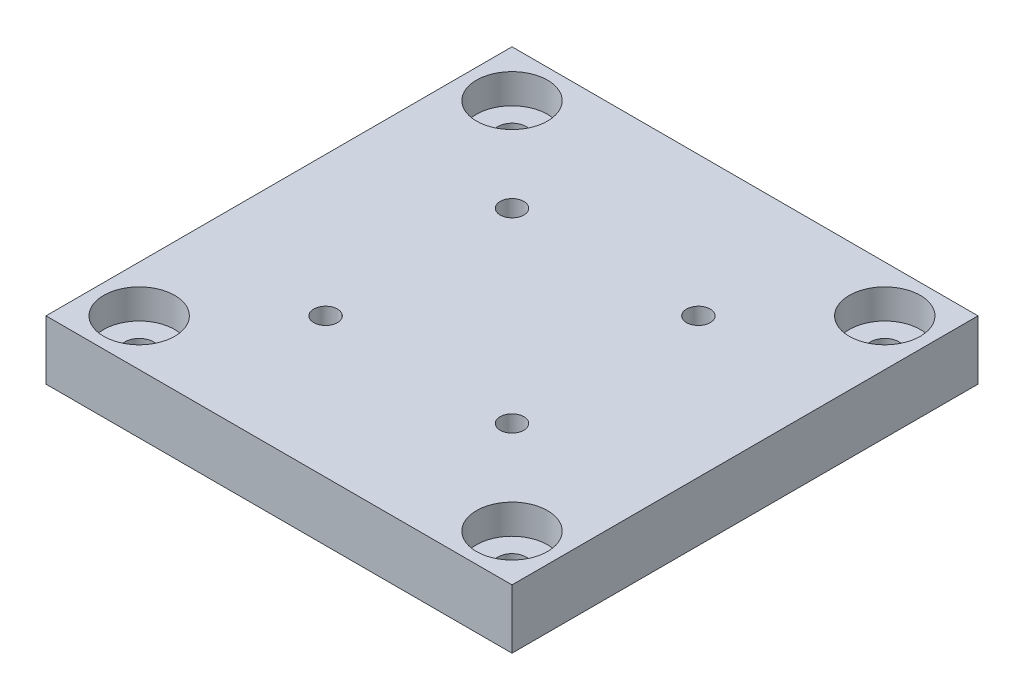
ISO-10303-21;
HEADER;
FILE_DESCRIPTION(('STEP AP214'),'2;1');
FILE_NAME('part.step','',(''),(''),'','','');
FILE_SCHEMA(('AUTOMOTIVE_DESIGN { 1 0 10303 214 1 1 1 1 }'));
ENDSEC;
DATA;
#1=APPLICATION_CONTEXT('core data for automotive mechanical design processes');
#2=APPLICATION_PROTOCOL_DEFINITION('international standard','automotive_design',2000,#1);
#3=PRODUCT_CONTEXT('',#1,'mechanical');
#4=PRODUCT('Part','Part','',(#3));
#5=PRODUCT_RELATED_PRODUCT_CATEGORY('part','',(#4));
#6=PRODUCT_DEFINITION_FORMATION('','',#4);
#7=PRODUCT_DEFINITION_CONTEXT('part definition',#1,'design');
#8=PRODUCT_DEFINITION('design','',#6,#7);
#9=PRODUCT_DEFINITION_SHAPE('','',#8);
#10=(LENGTH_UNIT() NAMED_UNIT(*) SI_UNIT(.MILLI.,.METRE.));
#11=(NAMED_UNIT(*) PLANE_ANGLE_UNIT() SI_UNIT($,.RADIAN.));
#12=(NAMED_UNIT(*) SI_UNIT($,.STERADIAN.) SOLID_ANGLE_UNIT());
#13=UNCERTAINTY_MEASURE_WITH_UNIT(LENGTH_MEASURE(1.E-05),#10,'distance_accuracy_value','');
#14=(GEOMETRIC_REPRESENTATION_CONTEXT(3) GLOBAL_UNCERTAINTY_ASSIGNED_CONTEXT((#13)) GLOBAL_UNIT_ASSIGNED_CONTEXT((#10,
#11,#12)) REPRESENTATION_CONTEXT('',''));
#15=CARTESIAN_POINT('',(0.,0.,0.));
#16=DIRECTION('',(0.,0.,1.));
#17=DIRECTION('',(1.,0.,0.));
#18=AXIS2_PLACEMENT_3D('',#15,#16,#17);
#19=CARTESIAN_POINT('',(4.99993919999998,6.35,-44.9999608));
#20=DIRECTION('',(0.,-1.,0.));
#21=DIRECTION('',(0.,0.,-1.));
#22=AXIS2_PLACEMENT_3D('',#19,#20,#21);
#23=CYLINDRICAL_SURFACE('',#22,1.524);
#24=CARTESIAN_POINT('',(4.99993919999998,0.,-44.9999608));
#25=DIRECTION('',(0.,1.,0.));
#26=DIRECTION('',(0.,0.,1.));
#27=AXIS2_PLACEMENT_3D('',#24,#25,#26);
#28=CIRCLE('',#27,1.524);
#29=CARTESIAN_POINT('',(4.99993919999998,0.,-43.4759608));
#30=VERTEX_POINT('',#29);
#31=EDGE_CURVE('E116',#30,#30,#28,.T.);
#32=ORIENTED_EDGE('',*,*,#31,.F.);
#33=EDGE_LOOP('',(#32));
#34=FACE_BOUND('',#33,.T.);
#35=CARTESIAN_POINT('',(4.99993919999998,3.175,-44.9999608));
#36=DIRECTION('',(0.,1.,0.));
#37=DIRECTION('',(0.,0.,1.));
#38=AXIS2_PLACEMENT_3D('',#35,#36,#37);
#39=CIRCLE('',#38,1.524);
#40=CARTESIAN_POINT('',(4.99993919999998,3.175,-43.4759608));
#41=VERTEX_POINT('',#40);
#42=EDGE_CURVE('E43',#41,#41,#39,.T.);
#43=ORIENTED_EDGE('',*,*,#42,.T.);
#44=EDGE_LOOP('',(#43));
#45=FACE_BOUND('',#44,.T.);
#46=ADVANCED_FACE('F39',(#34,#45),#23,.F.);
#47=CARTESIAN_POINT('',(44.9999608,6.35,-44.9999608));
#48=DIRECTION('',(0.,-1.,0.));
#49=DIRECTION('',(0.,0.,-1.));
#50=AXIS2_PLACEMENT_3D('',#47,#48,#49);
#51=CYLINDRICAL_SURFACE('',#50,1.524);
#52=CARTESIAN_POINT('',(44.9999608,0.,-44.9999608));
#53=DIRECTION('',(0.,1.,0.));
#54=DIRECTION('',(0.,0.,1.));
#55=AXIS2_PLACEMENT_3D('',#52,#53,#54);
#56=CIRCLE('',#55,1.524);
#57=CARTESIAN_POINT('',(44.9999608,0.,-43.4759608));
#58=VERTEX_POINT('',#57);
#59=EDGE_CURVE('E188',#58,#58,#56,.T.);
#60=ORIENTED_EDGE('',*,*,#59,.F.);
#61=EDGE_LOOP('',(#60));
#62=FACE_BOUND('',#61,.T.);
#63=CARTESIAN_POINT('',(44.9999608,3.175,-44.9999608));
#64=DIRECTION('',(0.,1.,0.));
#65=DIRECTION('',(0.,0.,1.));
#66=AXIS2_PLACEMENT_3D('',#63,#64,#65);
#67=CIRCLE('',#66,1.524);
#68=CARTESIAN_POINT('',(44.9999608,3.175,-43.4759608));
#69=VERTEX_POINT('',#68);
#70=EDGE_CURVE('E135',#69,#69,#67,.T.);
#71=ORIENTED_EDGE('',*,*,#70,.T.);
#72=EDGE_LOOP('',(#71));
#73=FACE_BOUND('',#72,.T.);
#74=ADVANCED_FACE('F201',(#62,#73),#51,.F.);
#75=CARTESIAN_POINT('',(44.9999608,6.35,-4.9999392));
#76=DIRECTION('',(0.,-1.,0.));
#77=DIRECTION('',(0.,0.,-1.));
#78=AXIS2_PLACEMENT_3D('',#75,#76,#77);
#79=CYLINDRICAL_SURFACE('',#78,1.524);
#80=CARTESIAN_POINT('',(44.9999608,0.,-4.9999392));
#81=DIRECTION('',(0.,1.,0.));
#82=DIRECTION('',(0.,0.,1.));
#83=AXIS2_PLACEMENT_3D('',#80,#81,#82);
#84=CIRCLE('',#83,1.524);
#85=CARTESIAN_POINT('',(44.9999608,0.,-3.4759392));
#86=VERTEX_POINT('',#85);
#87=EDGE_CURVE('E184',#86,#86,#84,.T.);
#88=ORIENTED_EDGE('',*,*,#87,.F.);
#89=EDGE_LOOP('',(#88));
#90=FACE_BOUND('',#89,.T.);
#91=CARTESIAN_POINT('',(44.9999608,3.175,-4.9999392));
#92=DIRECTION('',(0.,1.,0.));
#93=DIRECTION('',(0.,0.,1.));
#94=AXIS2_PLACEMENT_3D('',#91,#92,#93);
#95=CIRCLE('',#94,1.524);
#96=CARTESIAN_POINT('',(44.9999608,3.175,-3.4759392));
#97=VERTEX_POINT('',#96);
#98=EDGE_CURVE('E131',#97,#97,#95,.T.);
#99=ORIENTED_EDGE('',*,*,#98,.T.);
#100=EDGE_LOOP('',(#99));
#101=FACE_BOUND('',#100,.T.);
#102=ADVANCED_FACE('F206',(#90,#101),#79,.F.);
#103=CARTESIAN_POINT('',(4.99993919999999,6.35,-4.99993919999999));
#104=DIRECTION('',(0.,-1.,0.));
#105=DIRECTION('',(0.,0.,-1.));
#106=AXIS2_PLACEMENT_3D('',#103,#104,#105);
#107=CYLINDRICAL_SURFACE('',#106,1.524);
#108=CARTESIAN_POINT('',(4.99993919999999,0.,-4.99993919999999));
#109=DIRECTION('',(0.,1.,0.));
#110=DIRECTION('',(0.,0.,1.));
#111=AXIS2_PLACEMENT_3D('',#108,#109,#110);
#112=CIRCLE('',#111,1.524);
#113=CARTESIAN_POINT('',(4.99993919999999,0.,-3.47593919999999));
#114=VERTEX_POINT('',#113);
#115=EDGE_CURVE('E177',#114,#114,#112,.T.);
#116=ORIENTED_EDGE('',*,*,#115,.F.);
#117=EDGE_LOOP('',(#116));
#118=FACE_BOUND('',#117,.T.);
#119=CARTESIAN_POINT('',(4.99993919999999,3.175,-4.99993919999999));
#120=DIRECTION('',(0.,1.,0.));
#121=DIRECTION('',(0.,0.,1.));
#122=AXIS2_PLACEMENT_3D('',#119,#120,#121);
#123=CIRCLE('',#122,1.524);
#124=CARTESIAN_POINT('',(4.99993919999999,3.175,-3.47593919999999));
#125=VERTEX_POINT('',#124);
#126=EDGE_CURVE('E127',#125,#125,#123,.T.);
#127=ORIENTED_EDGE('',*,*,#126,.T.);
#128=EDGE_LOOP('',(#127));
#129=FACE_BOUND('',#128,.T.);
#130=ADVANCED_FACE('F213',(#118,#129),#107,.F.);
#131=CARTESIAN_POINT('',(0.,6.35,0.));
#132=DIRECTION('',(0.,-1.,0.));
#133=DIRECTION('',(0.,0.,-1.));
#134=AXIS2_PLACEMENT_3D('',#131,#132,#133);
#135=PLANE('',#134);
#136=CARTESIAN_POINT('',(44.9999608,6.35,-44.9999608));
#137=DIRECTION('',(0.,1.,0.));
#138=DIRECTION('',(0.,0.,1.));
#139=AXIS2_PLACEMENT_3D('',#136,#137,#138);
#140=CIRCLE('',#139,3.81);
#141=CARTESIAN_POINT('',(44.9999608,6.35,-41.1899608));
#142=VERTEX_POINT('',#141);
#143=EDGE_CURVE('E291',#142,#142,#140,.T.);
#144=ORIENTED_EDGE('',*,*,#143,.F.);
#145=EDGE_LOOP('',(#144));
#146=FACE_BOUND('',#145,.T.);
#147=CARTESIAN_POINT('',(4.99993919999999,6.35,-4.99993919999999));
#148=DIRECTION('',(0.,1.,0.));
#149=DIRECTION('',(0.,0.,1.));
#150=AXIS2_PLACEMENT_3D('',#147,#148,#149);
#151=CIRCLE('',#150,3.81);
#152=CARTESIAN_POINT('',(4.99993919999999,6.35,-1.18993919999999));
#153=VERTEX_POINT('',#152);
#154=EDGE_CURVE('E275',#153,#153,#151,.T.);
#155=ORIENTED_EDGE('',*,*,#154,.F.);
#156=EDGE_LOOP('',(#155));
#157=FACE_BOUND('',#156,.T.);
#158=CARTESIAN_POINT('',(44.9999608,6.35,-4.9999392));
#159=DIRECTION('',(0.,1.,0.));
#160=DIRECTION('',(0.,0.,1.));
#161=AXIS2_PLACEMENT_3D('',#158,#159,#160);
#162=CIRCLE('',#161,3.81);
#163=CARTESIAN_POINT('',(44.9999608,6.35,-1.1899392));
#164=VERTEX_POINT('',#163);
#165=EDGE_CURVE('E276',#164,#164,#162,.T.);
#166=ORIENTED_EDGE('',*,*,#165,.F.);
#167=EDGE_LOOP('',(#166));
#168=FACE_BOUND('',#167,.T.);
#169=CARTESIAN_POINT('',(4.99993919999998,6.35,-44.9999608));
#170=DIRECTION('',(0.,1.,0.));
#171=DIRECTION('',(0.,0.,1.));
#172=AXIS2_PLACEMENT_3D('',#169,#170,#171);
#173=CIRCLE('',#172,3.81);
#174=CARTESIAN_POINT('',(4.99993919999998,6.35,-41.1899608));
#175=VERTEX_POINT('',#174);
#176=EDGE_CURVE('E290',#175,#175,#173,.T.);
#177=ORIENTED_EDGE('',*,*,#176,.F.);
#178=EDGE_LOOP('',(#177));
#179=FACE_BOUND('',#178,.T.);
#180=DIRECTION('',(1.,0.,0.));
#181=VECTOR('',#180,1.);
#182=CARTESIAN_POINT('',(49.9999,6.35,0.));
#183=LINE('',#182,#181);
#184=CARTESIAN_POINT('',(0.,6.35,0.));
#185=VERTEX_POINT('',#184);
#186=CARTESIAN_POINT('',(49.9999,6.35,0.));
#187=VERTEX_POINT('',#186);
#188=EDGE_CURVE('E95',#185,#187,#183,.T.);
#189=ORIENTED_EDGE('',*,*,#188,.T.);
#190=DIRECTION('',(0.,0.,-1.));
#191=VECTOR('',#190,1.);
#192=CARTESIAN_POINT('',(49.9999,6.35,-49.9999));
#193=LINE('',#192,#191);
#194=CARTESIAN_POINT('',(49.9999,6.35,-49.9999));
#195=VERTEX_POINT('',#194);
#196=EDGE_CURVE('E89',#187,#195,#193,.T.);
#197=ORIENTED_EDGE('',*,*,#196,.T.);
#198=DIRECTION('',(-1.,0.,0.));
#199=VECTOR('',#198,1.);
#200=CARTESIAN_POINT('',(0.,6.35,-49.9999));
#201=LINE('',#200,#199);
#202=CARTESIAN_POINT('',(0.,6.35,-49.9999));
#203=VERTEX_POINT('',#202);
#204=EDGE_CURVE('E93',#195,#203,#201,.T.);
#205=ORIENTED_EDGE('',*,*,#204,.T.);
#206=DIRECTION('',(0.,0.,1.));
#207=VECTOR('',#206,1.);
#208=CARTESIAN_POINT('',(0.,6.35,0.));
#209=LINE('',#208,#207);
#210=EDGE_CURVE('E59',#203,#185,#209,.T.);
#211=ORIENTED_EDGE('',*,*,#210,.T.);
#212=EDGE_LOOP('',(#189,#197,#205,#211));
#213=FACE_BOUND('',#212,.T.);
#214=CARTESIAN_POINT('',(14.9999446,6.35,-34.9999554));
#215=DIRECTION('',(0.,1.,0.));
#216=DIRECTION('',(0.,0.,1.));
#217=AXIS2_PLACEMENT_3D('',#214,#215,#216);
#218=CIRCLE('',#217,1.27000000000002);
#219=CARTESIAN_POINT('',(14.9999446,6.35,-33.7299554));
#220=VERTEX_POINT('',#219);
#221=EDGE_CURVE('E173',#220,#220,#218,.T.);
#222=ORIENTED_EDGE('',*,*,#221,.F.);
#223=EDGE_LOOP('',(#222));
#224=FACE_BOUND('',#223,.T.);
#225=CARTESIAN_POINT('',(34.9999554,6.35,-34.9999554));
#226=DIRECTION('',(0.,1.,0.));
#227=DIRECTION('',(0.,0.,1.));
#228=AXIS2_PLACEMENT_3D('',#225,#226,#227);
#229=CIRCLE('',#228,1.27);
#230=CARTESIAN_POINT('',(34.9999554,6.35,-33.7299554));
#231=VERTEX_POINT('',#230);
#232=EDGE_CURVE('E165',#231,#231,#229,.T.);
#233=ORIENTED_EDGE('',*,*,#232,.F.);
#234=EDGE_LOOP('',(#233));
#235=FACE_BOUND('',#234,.T.);
#236=CARTESIAN_POINT('',(34.9999554,6.35,-14.9999446));
#237=DIRECTION('',(0.,1.,0.));
#238=DIRECTION('',(0.,0.,1.));
#239=AXIS2_PLACEMENT_3D('',#236,#237,#238);
#240=CIRCLE('',#239,1.27);
#241=CARTESIAN_POINT('',(34.9999554,6.35,-13.7299446));
#242=VERTEX_POINT('',#241);
#243=EDGE_CURVE('E157',#242,#242,#240,.T.);
#244=ORIENTED_EDGE('',*,*,#243,.F.);
#245=EDGE_LOOP('',(#244));
#246=FACE_BOUND('',#245,.T.);
#247=CARTESIAN_POINT('',(14.9999446,6.35,-14.9999446));
#248=DIRECTION('',(0.,1.,0.));
#249=DIRECTION('',(0.,0.,1.));
#250=AXIS2_PLACEMENT_3D('',#247,#248,#249);
#251=CIRCLE('',#250,1.27);
#252=CARTESIAN_POINT('',(14.9999446,6.35,-13.7299446));
#253=VERTEX_POINT('',#252);
#254=EDGE_CURVE('E147',#253,#253,#251,.T.);
#255=ORIENTED_EDGE('',*,*,#254,.F.);
#256=EDGE_LOOP('',(#255));
#257=FACE_BOUND('',#256,.T.);
#258=ADVANCED_FACE('F90',(#146,#157,#168,#179,#213,#224,#235,#246,#257),#135,.F.);
#259=CARTESIAN_POINT('',(0.,0.,0.));
#260=DIRECTION('',(0.,-1.,0.));
#261=DIRECTION('',(0.,0.,-1.));
#262=AXIS2_PLACEMENT_3D('',#259,#260,#261);
#263=PLANE('',#262);
#264=CARTESIAN_POINT('',(34.9999554,0.,-14.9999446));
#265=DIRECTION('',(0.,1.,0.));
#266=DIRECTION('',(0.,0.,1.));
#267=AXIS2_PLACEMENT_3D('',#264,#265,#266);
#268=CIRCLE('',#267,1.27);
#269=CARTESIAN_POINT('',(34.9999554,0.,-13.7299446));
#270=VERTEX_POINT('',#269);
#271=EDGE_CURVE('E153',#270,#270,#268,.T.);
#272=ORIENTED_EDGE('',*,*,#271,.T.);
#273=EDGE_LOOP('',(#272));
#274=FACE_BOUND('',#273,.T.);
#275=CARTESIAN_POINT('',(14.9999446,0.,-34.9999554));
#276=DIRECTION('',(0.,1.,0.));
#277=DIRECTION('',(0.,0.,1.));
#278=AXIS2_PLACEMENT_3D('',#275,#276,#277);
#279=CIRCLE('',#278,1.27000000000002);
#280=CARTESIAN_POINT('',(14.9999446,0.,-33.7299554));
#281=VERTEX_POINT('',#280);
#282=EDGE_CURVE('E169',#281,#281,#279,.T.);
#283=ORIENTED_EDGE('',*,*,#282,.T.);
#284=EDGE_LOOP('',(#283));
#285=FACE_BOUND('',#284,.T.);
#286=ORIENTED_EDGE('',*,*,#87,.T.);
#287=EDGE_LOOP('',(#286));
#288=FACE_BOUND('',#287,.T.);
#289=ORIENTED_EDGE('',*,*,#31,.T.);
#290=EDGE_LOOP('',(#289));
#291=FACE_BOUND('',#290,.T.);
#292=DIRECTION('',(1.,0.,0.));
#293=VECTOR('',#292,1.);
#294=CARTESIAN_POINT('',(49.9999,0.,0.));
#295=LINE('',#294,#293);
#296=CARTESIAN_POINT('',(0.,0.,0.));
#297=VERTEX_POINT('',#296);
#298=CARTESIAN_POINT('',(49.9999,0.,0.));
#299=VERTEX_POINT('',#298);
#300=EDGE_CURVE('E112',#297,#299,#295,.T.);
#301=ORIENTED_EDGE('',*,*,#300,.F.);
#302=DIRECTION('',(0.,0.,1.));
#303=VECTOR('',#302,1.);
#304=CARTESIAN_POINT('',(0.,0.,0.));
#305=LINE('',#304,#303);
#306=CARTESIAN_POINT('',(0.,0.,-49.9999));
#307=VERTEX_POINT('',#306);
#308=EDGE_CURVE('E82',#307,#297,#305,.T.);
#309=ORIENTED_EDGE('',*,*,#308,.F.);
#310=DIRECTION('',(-1.,0.,0.));
#311=VECTOR('',#310,1.);
#312=CARTESIAN_POINT('',(0.,0.,-49.9999));
#313=LINE('',#312,#311);
#314=CARTESIAN_POINT('',(49.9999,0.,-49.9999));
#315=VERTEX_POINT('',#314);
#316=EDGE_CURVE('E76',#315,#307,#313,.T.);
#317=ORIENTED_EDGE('',*,*,#316,.F.);
#318=DIRECTION('',(0.,0.,-1.));
#319=VECTOR('',#318,1.);
#320=CARTESIAN_POINT('',(49.9999,0.,-49.9999));
#321=LINE('',#320,#319);
#322=EDGE_CURVE('E100',#299,#315,#321,.T.);
#323=ORIENTED_EDGE('',*,*,#322,.F.);
#324=EDGE_LOOP('',(#301,#309,#317,#323));
#325=FACE_BOUND('',#324,.T.);
#326=ORIENTED_EDGE('',*,*,#59,.T.);
#327=EDGE_LOOP('',(#326));
#328=FACE_BOUND('',#327,.T.);
#329=ORIENTED_EDGE('',*,*,#115,.T.);
#330=EDGE_LOOP('',(#329));
#331=FACE_BOUND('',#330,.T.);
#332=CARTESIAN_POINT('',(34.9999554,0.,-34.9999554));
#333=DIRECTION('',(0.,1.,0.));
#334=DIRECTION('',(0.,0.,1.));
#335=AXIS2_PLACEMENT_3D('',#332,#333,#334);
#336=CIRCLE('',#335,1.27);
#337=CARTESIAN_POINT('',(34.9999554,0.,-33.7299554));
#338=VERTEX_POINT('',#337);
#339=EDGE_CURVE('E161',#338,#338,#336,.T.);
#340=ORIENTED_EDGE('',*,*,#339,.T.);
#341=EDGE_LOOP('',(#340));
#342=FACE_BOUND('',#341,.T.);
#343=CARTESIAN_POINT('',(14.9999446,0.,-14.9999446));
#344=DIRECTION('',(0.,1.,0.));
#345=DIRECTION('',(0.,0.,1.));
#346=AXIS2_PLACEMENT_3D('',#343,#344,#345);
#347=CIRCLE('',#346,1.27);
#348=CARTESIAN_POINT('',(14.9999446,0.,-13.7299446));
#349=VERTEX_POINT('',#348);
#350=EDGE_CURVE('E142',#349,#349,#347,.T.);
#351=ORIENTED_EDGE('',*,*,#350,.T.);
#352=EDGE_LOOP('',(#351));
#353=FACE_BOUND('',#352,.T.);
#354=ADVANCED_FACE('F197',(#274,#285,#288,#291,#325,#328,#331,#342,#353),#263,.T.);
#355=CARTESIAN_POINT('',(49.9999,6.35,0.));
#356=DIRECTION('',(0.,0.,-1.));
#357=DIRECTION('',(-1.,0.,0.));
#358=AXIS2_PLACEMENT_3D('',#355,#356,#357);
#359=PLANE('',#358);
#360=ORIENTED_EDGE('',*,*,#300,.T.);
#361=DIRECTION('',(0.,-1.,0.));
#362=VECTOR('',#361,1.);
#363=CARTESIAN_POINT('',(49.9999,6.35,0.));
#364=LINE('',#363,#362);
#365=EDGE_CURVE('E11',#187,#299,#364,.T.);
#366=ORIENTED_EDGE('',*,*,#365,.F.);
#367=ORIENTED_EDGE('',*,*,#188,.F.);
#368=DIRECTION('',(0.,-1.,0.));
#369=VECTOR('',#368,1.);
#370=CARTESIAN_POINT('',(0.,6.35,0.));
#371=LINE('',#370,#369);
#372=EDGE_CURVE('E108',#185,#297,#371,.T.);
#373=ORIENTED_EDGE('',*,*,#372,.T.);
#374=EDGE_LOOP('',(#360,#366,#367,#373));
#375=FACE_BOUND('',#374,.T.);
#376=ADVANCED_FACE('F41',(#375),#359,.F.);
#377=CARTESIAN_POINT('',(49.9999,6.35,-49.9999));
#378=DIRECTION('',(-1.,0.,0.));
#379=DIRECTION('',(0.,0.,1.));
#380=AXIS2_PLACEMENT_3D('',#377,#378,#379);
#381=PLANE('',#380);
#382=ORIENTED_EDGE('',*,*,#322,.T.);
#383=DIRECTION('',(0.,-1.,0.));
#384=VECTOR('',#383,1.);
#385=CARTESIAN_POINT('',(49.9999,6.35,-49.9999));
#386=LINE('',#385,#384);
#387=EDGE_CURVE('E50',#195,#315,#386,.T.);
#388=ORIENTED_EDGE('',*,*,#387,.F.);
#389=ORIENTED_EDGE('',*,*,#196,.F.);
#390=ORIENTED_EDGE('',*,*,#365,.T.);
#391=EDGE_LOOP('',(#382,#388,#389,#390));
#392=FACE_BOUND('',#391,.T.);
#393=ADVANCED_FACE('F99',(#392),#381,.F.);
#394=CARTESIAN_POINT('',(0.,6.35,-49.9999));
#395=DIRECTION('',(0.,0.,1.));
#396=DIRECTION('',(1.,0.,0.));
#397=AXIS2_PLACEMENT_3D('',#394,#395,#396);
#398=PLANE('',#397);
#399=ORIENTED_EDGE('',*,*,#316,.T.);
#400=DIRECTION('',(0.,-1.,0.));
#401=VECTOR('',#400,1.);
#402=CARTESIAN_POINT('',(0.,6.35,-49.9999));
#403=LINE('',#402,#401);
#404=EDGE_CURVE('E102',#203,#307,#403,.T.);
#405=ORIENTED_EDGE('',*,*,#404,.F.);
#406=ORIENTED_EDGE('',*,*,#204,.F.);
#407=ORIENTED_EDGE('',*,*,#387,.T.);
#408=EDGE_LOOP('',(#399,#405,#406,#407));
#409=FACE_BOUND('',#408,.T.);
#410=ADVANCED_FACE('F104',(#409),#398,.F.);
#411=CARTESIAN_POINT('',(0.,6.35,0.));
#412=DIRECTION('',(1.,0.,0.));
#413=DIRECTION('',(0.,0.,-1.));
#414=AXIS2_PLACEMENT_3D('',#411,#412,#413);
#415=PLANE('',#414);
#416=ORIENTED_EDGE('',*,*,#308,.T.);
#417=ORIENTED_EDGE('',*,*,#372,.F.);
#418=ORIENTED_EDGE('',*,*,#210,.F.);
#419=ORIENTED_EDGE('',*,*,#404,.T.);
#420=EDGE_LOOP('',(#416,#417,#418,#419));
#421=FACE_BOUND('',#420,.T.);
#422=ADVANCED_FACE('F218',(#421),#415,.F.);
#423=CARTESIAN_POINT('',(14.9999446,6.35,-34.9999554));
#424=DIRECTION('',(0.,-1.,0.));
#425=DIRECTION('',(0.,0.,-1.));
#426=AXIS2_PLACEMENT_3D('',#423,#424,#425);
#427=CYLINDRICAL_SURFACE('',#426,1.27000000000002);
#428=ORIENTED_EDGE('',*,*,#221,.T.);
#429=EDGE_LOOP('',(#428));
#430=FACE_BOUND('',#429,.T.);
#431=ORIENTED_EDGE('',*,*,#282,.F.);
#432=EDGE_LOOP('',(#431));
#433=FACE_BOUND('',#432,.T.);
#434=ADVANCED_FACE('F221',(#430,#433),#427,.F.);
#435=CARTESIAN_POINT('',(34.9999554,6.35,-34.9999554));
#436=DIRECTION('',(0.,-1.,0.));
#437=DIRECTION('',(0.,0.,-1.));
#438=AXIS2_PLACEMENT_3D('',#435,#436,#437);
#439=CYLINDRICAL_SURFACE('',#438,1.27);
#440=ORIENTED_EDGE('',*,*,#232,.T.);
#441=EDGE_LOOP('',(#440));
#442=FACE_BOUND('',#441,.T.);
#443=ORIENTED_EDGE('',*,*,#339,.F.);
#444=EDGE_LOOP('',(#443));
#445=FACE_BOUND('',#444,.T.);
#446=ADVANCED_FACE('F238',(#442,#445),#439,.F.);
#447=CARTESIAN_POINT('',(34.9999554,6.35,-14.9999446));
#448=DIRECTION('',(0.,-1.,0.));
#449=DIRECTION('',(0.,0.,-1.));
#450=AXIS2_PLACEMENT_3D('',#447,#448,#449);
#451=CYLINDRICAL_SURFACE('',#450,1.27);
#452=ORIENTED_EDGE('',*,*,#243,.T.);
#453=EDGE_LOOP('',(#452));
#454=FACE_BOUND('',#453,.T.);
#455=ORIENTED_EDGE('',*,*,#271,.F.);
#456=EDGE_LOOP('',(#455));
#457=FACE_BOUND('',#456,.T.);
#458=ADVANCED_FACE('F240',(#454,#457),#451,.F.);
#459=CARTESIAN_POINT('',(14.9999446,6.35,-14.9999446));
#460=DIRECTION('',(0.,-1.,0.));
#461=DIRECTION('',(0.,0.,-1.));
#462=AXIS2_PLACEMENT_3D('',#459,#460,#461);
#463=CYLINDRICAL_SURFACE('',#462,1.27);
#464=ORIENTED_EDGE('',*,*,#254,.T.);
#465=EDGE_LOOP('',(#464));
#466=FACE_BOUND('',#465,.T.);
#467=ORIENTED_EDGE('',*,*,#350,.F.);
#468=EDGE_LOOP('',(#467));
#469=FACE_BOUND('',#468,.T.);
#470=ADVANCED_FACE('F247',(#466,#469),#463,.F.);
#471=CARTESIAN_POINT('',(4.99993919999999,3.175,-4.99993919999999));
#472=DIRECTION('',(0.,1.,0.));
#473=DIRECTION('',(0.,0.,1.));
#474=AXIS2_PLACEMENT_3D('',#471,#472,#473);
#475=CYLINDRICAL_SURFACE('',#474,3.81);
#476=CARTESIAN_POINT('',(4.99993919999999,3.175,-4.99993919999999));
#477=DIRECTION('',(0.,1.,0.));
#478=DIRECTION('',(0.,0.,1.));
#479=AXIS2_PLACEMENT_3D('',#476,#477,#478);
#480=CIRCLE('',#479,3.81);
#481=CARTESIAN_POINT('',(4.99993919999999,3.175,-1.18993919999999));
#482=VERTEX_POINT('',#481);
#483=EDGE_CURVE('E281',#482,#482,#480,.T.);
#484=ORIENTED_EDGE('',*,*,#483,.F.);
#485=EDGE_LOOP('',(#484));
#486=FACE_BOUND('',#485,.T.);
#487=ORIENTED_EDGE('',*,*,#154,.T.);
#488=EDGE_LOOP('',(#487));
#489=FACE_BOUND('',#488,.T.);
#490=ADVANCED_FACE('F322',(#486,#489),#475,.F.);
#491=CARTESIAN_POINT('',(4.99993919999999,3.175,-4.99993919999999));
#492=DIRECTION('',(0.,1.,0.));
#493=DIRECTION('',(0.,0.,1.));
#494=AXIS2_PLACEMENT_3D('',#491,#492,#493);
#495=PLANE('',#494);
#496=ORIENTED_EDGE('',*,*,#126,.F.);
#497=EDGE_LOOP('',(#496));
#498=FACE_BOUND('',#497,.T.);
#499=ORIENTED_EDGE('',*,*,#483,.T.);
#500=EDGE_LOOP('',(#499));
#501=FACE_BOUND('',#500,.T.);
#502=ADVANCED_FACE('F327',(#498,#501),#495,.T.);
#503=CARTESIAN_POINT('',(44.9999608,3.175,-4.9999392));
#504=DIRECTION('',(0.,1.,0.));
#505=DIRECTION('',(0.,0.,1.));
#506=AXIS2_PLACEMENT_3D('',#503,#504,#505);
#507=CYLINDRICAL_SURFACE('',#506,3.81);
#508=CARTESIAN_POINT('',(44.9999608,3.175,-4.9999392));
#509=DIRECTION('',(0.,1.,0.));
#510=DIRECTION('',(0.,0.,1.));
#511=AXIS2_PLACEMENT_3D('',#508,#509,#510);
#512=CIRCLE('',#511,3.81);
#513=CARTESIAN_POINT('',(44.9999608,3.175,-1.1899392));
#514=VERTEX_POINT('',#513);
#515=EDGE_CURVE('E272',#514,#514,#512,.T.);
#516=ORIENTED_EDGE('',*,*,#515,.F.);
#517=EDGE_LOOP('',(#516));
#518=FACE_BOUND('',#517,.T.);
#519=ORIENTED_EDGE('',*,*,#165,.T.);
#520=EDGE_LOOP('',(#519));
#521=FACE_BOUND('',#520,.T.);
#522=ADVANCED_FACE('F268',(#518,#521),#507,.F.);
#523=CARTESIAN_POINT('',(44.9999608,3.175,-4.9999392));
#524=DIRECTION('',(0.,1.,0.));
#525=DIRECTION('',(0.,0.,1.));
#526=AXIS2_PLACEMENT_3D('',#523,#524,#525);
#527=PLANE('',#526);
#528=ORIENTED_EDGE('',*,*,#98,.F.);
#529=EDGE_LOOP('',(#528));
#530=FACE_BOUND('',#529,.T.);
#531=ORIENTED_EDGE('',*,*,#515,.T.);
#532=EDGE_LOOP('',(#531));
#533=FACE_BOUND('',#532,.T.);
#534=ADVANCED_FACE('F264',(#530,#533),#527,.T.);
#535=CARTESIAN_POINT('',(44.9999608,3.175,-44.9999608));
#536=DIRECTION('',(0.,1.,0.));
#537=DIRECTION('',(0.,0.,1.));
#538=AXIS2_PLACEMENT_3D('',#535,#536,#537);
#539=CYLINDRICAL_SURFACE('',#538,3.81);
#540=CARTESIAN_POINT('',(44.9999608,3.175,-44.9999608));
#541=DIRECTION('',(0.,1.,0.));
#542=DIRECTION('',(0.,0.,1.));
#543=AXIS2_PLACEMENT_3D('',#540,#541,#542);
#544=CIRCLE('',#543,3.81);
#545=CARTESIAN_POINT('',(44.9999608,3.175,-41.1899608));
#546=VERTEX_POINT('',#545);
#547=EDGE_CURVE('E286',#546,#546,#544,.T.);
#548=ORIENTED_EDGE('',*,*,#547,.F.);
#549=EDGE_LOOP('',(#548));
#550=FACE_BOUND('',#549,.T.);
#551=ORIENTED_EDGE('',*,*,#143,.T.);
#552=EDGE_LOOP('',(#551));
#553=FACE_BOUND('',#552,.T.);
#554=ADVANCED_FACE('F267',(#550,#553),#539,.F.);
#555=CARTESIAN_POINT('',(44.9999608,3.175,-44.9999608));
#556=DIRECTION('',(0.,1.,0.));
#557=DIRECTION('',(0.,0.,1.));
#558=AXIS2_PLACEMENT_3D('',#555,#556,#557);
#559=PLANE('',#558);
#560=ORIENTED_EDGE('',*,*,#70,.F.);
#561=EDGE_LOOP('',(#560));
#562=FACE_BOUND('',#561,.T.);
#563=ORIENTED_EDGE('',*,*,#547,.T.);
#564=EDGE_LOOP('',(#563));
#565=FACE_BOUND('',#564,.T.);
#566=ADVANCED_FACE('F308',(#562,#565),#559,.T.);
#567=CARTESIAN_POINT('',(4.99993919999998,3.175,-44.9999608));
#568=DIRECTION('',(0.,1.,0.));
#569=DIRECTION('',(0.,0.,1.));
#570=AXIS2_PLACEMENT_3D('',#567,#568,#569);
#571=CYLINDRICAL_SURFACE('',#570,3.81);
#572=CARTESIAN_POINT('',(4.99993919999998,3.175,-44.9999608));
#573=DIRECTION('',(0.,1.,0.));
#574=DIRECTION('',(0.,0.,1.));
#575=AXIS2_PLACEMENT_3D('',#572,#573,#574);
#576=CIRCLE('',#575,3.81);
#577=CARTESIAN_POINT('',(4.99993919999998,3.175,-41.1899608));
#578=VERTEX_POINT('',#577);
#579=EDGE_CURVE('E132',#578,#578,#576,.T.);
#580=ORIENTED_EDGE('',*,*,#579,.F.);
#581=EDGE_LOOP('',(#580));
#582=FACE_BOUND('',#581,.T.);
#583=ORIENTED_EDGE('',*,*,#176,.T.);
#584=EDGE_LOOP('',(#583));
#585=FACE_BOUND('',#584,.T.);
#586=ADVANCED_FACE('F304',(#582,#585),#571,.F.);
#587=CARTESIAN_POINT('',(4.99993919999998,3.175,-44.9999608));
#588=DIRECTION('',(0.,1.,0.));
#589=DIRECTION('',(0.,0.,1.));
#590=AXIS2_PLACEMENT_3D('',#587,#588,#589);
#591=PLANE('',#590);
#592=ORIENTED_EDGE('',*,*,#42,.F.);
#593=EDGE_LOOP('',(#592));
#594=FACE_BOUND('',#593,.T.);
#595=ORIENTED_EDGE('',*,*,#579,.T.);
#596=EDGE_LOOP('',(#595));
#597=FACE_BOUND('',#596,.T.);
#598=ADVANCED_FACE('F307',(#594,#597),#591,.T.);
#599=CLOSED_SHELL('',(#46,#74,#102,#130,#258,#354,#376,#393,#410,#422,#434,#446,#458,#470,#490,
#502,#522,#534,#554,#566,#586,#598));
#600=MANIFOLD_SOLID_BREP('B2',#599);
#601=ADVANCED_BREP_SHAPE_REPRESENTATION('',(#18,#600),#14);
#602=SHAPE_DEFINITION_REPRESENTATION(#9,#601);
ENDSEC;
END-ISO-10303-21;
